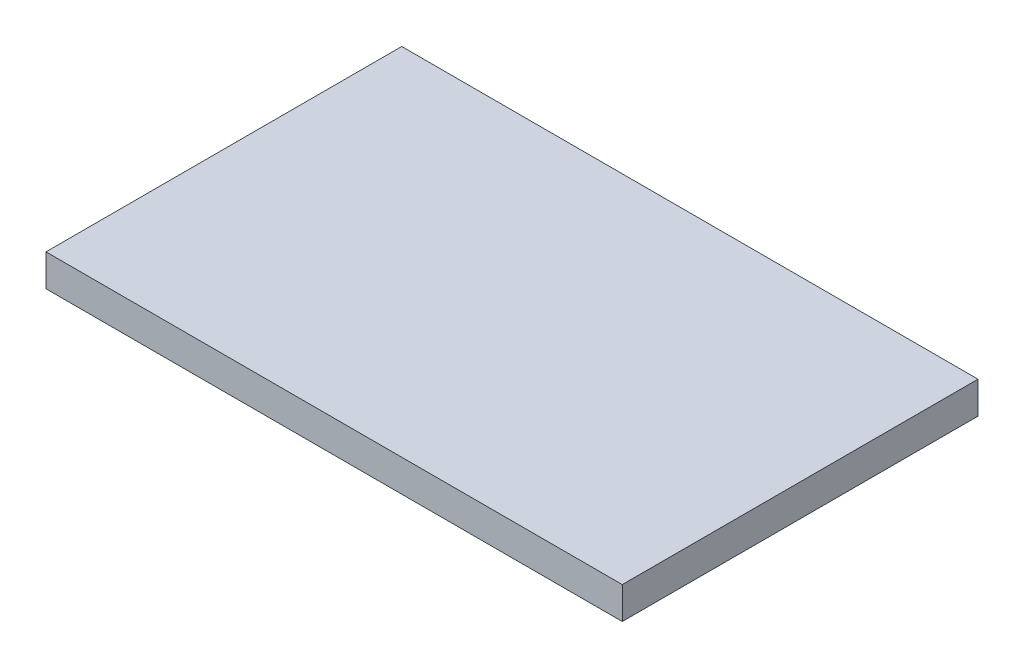
ISO-10303-21;
HEADER;
FILE_DESCRIPTION(('STEP AP214'),'2;1');
FILE_NAME('part.step','',(''),(''),'','','');
FILE_SCHEMA(('AUTOMOTIVE_DESIGN { 1 0 10303 214 1 1 1 1 }'));
ENDSEC;
DATA;
#1=APPLICATION_CONTEXT('core data for automotive mechanical design processes');
#2=APPLICATION_PROTOCOL_DEFINITION('international standard','automotive_design',2000,#1);
#3=PRODUCT_CONTEXT('',#1,'mechanical');
#4=PRODUCT('Part','Part','',(#3));
#5=PRODUCT_RELATED_PRODUCT_CATEGORY('part','',(#4));
#6=PRODUCT_DEFINITION_FORMATION('','',#4);
#7=PRODUCT_DEFINITION_CONTEXT('part definition',#1,'design');
#8=PRODUCT_DEFINITION('design','',#6,#7);
#9=PRODUCT_DEFINITION_SHAPE('','',#8);
#10=(LENGTH_UNIT() NAMED_UNIT(*) SI_UNIT(.MILLI.,.METRE.));
#11=(NAMED_UNIT(*) PLANE_ANGLE_UNIT() SI_UNIT($,.RADIAN.));
#12=(NAMED_UNIT(*) SI_UNIT($,.STERADIAN.) SOLID_ANGLE_UNIT());
#13=UNCERTAINTY_MEASURE_WITH_UNIT(LENGTH_MEASURE(1.E-05),#10,'distance_accuracy_value','');
#14=(GEOMETRIC_REPRESENTATION_CONTEXT(3) GLOBAL_UNCERTAINTY_ASSIGNED_CONTEXT((#13)) GLOBAL_UNIT_ASSIGNED_CONTEXT((#10,
#11,#12)) REPRESENTATION_CONTEXT('',''));
#15=CARTESIAN_POINT('',(0.,0.,0.));
#16=DIRECTION('',(0.,0.,1.));
#17=DIRECTION('',(1.,0.,0.));
#18=AXIS2_PLACEMENT_3D('',#15,#16,#17);
#19=CARTESIAN_POINT('',(40.5,4.5,-25.));
#20=DIRECTION('',(-1.,0.,0.));
#21=DIRECTION('',(0.,0.,1.));
#22=AXIS2_PLACEMENT_3D('',#19,#20,#21);
#23=PLANE('',#22);
#24=DIRECTION('',(0.,0.,-1.));
#25=VECTOR('',#24,1.);
#26=CARTESIAN_POINT('',(40.5,0.,-25.));
#27=LINE('',#26,#25);
#28=CARTESIAN_POINT('',(40.5,0.,25.));
#29=VERTEX_POINT('',#28);
#30=CARTESIAN_POINT('',(40.5,0.,-25.));
#31=VERTEX_POINT('',#30);
#32=EDGE_CURVE('E96',#29,#31,#27,.T.);
#33=ORIENTED_EDGE('',*,*,#32,.T.);
#34=DIRECTION('',(0.,-1.,0.));
#35=VECTOR('',#34,1.);
#36=CARTESIAN_POINT('',(40.5,4.5,-25.));
#37=LINE('',#36,#35);
#38=CARTESIAN_POINT('',(40.5,4.5,-25.));
#39=VERTEX_POINT('',#38);
#40=EDGE_CURVE('E11',#39,#31,#37,.T.);
#41=ORIENTED_EDGE('',*,*,#40,.F.);
#42=DIRECTION('',(0.,0.,-1.));
#43=VECTOR('',#42,1.);
#44=CARTESIAN_POINT('',(40.5,4.5,-25.));
#45=LINE('',#44,#43);
#46=CARTESIAN_POINT('',(40.5,4.5,25.));
#47=VERTEX_POINT('',#46);
#48=EDGE_CURVE('E84',#47,#39,#45,.T.);
#49=ORIENTED_EDGE('',*,*,#48,.F.);
#50=DIRECTION('',(0.,-1.,0.));
#51=VECTOR('',#50,1.);
#52=CARTESIAN_POINT('',(40.5,4.5,25.));
#53=LINE('',#52,#51);
#54=EDGE_CURVE('E92',#47,#29,#53,.T.);
#55=ORIENTED_EDGE('',*,*,#54,.T.);
#56=EDGE_LOOP('',(#33,#41,#49,#55));
#57=FACE_BOUND('',#56,.T.);
#58=ADVANCED_FACE('F33',(#57),#23,.F.);
#59=CARTESIAN_POINT('',(-40.5,4.5,-25.));
#60=DIRECTION('',(0.,0.,1.));
#61=DIRECTION('',(1.,0.,0.));
#62=AXIS2_PLACEMENT_3D('',#59,#60,#61);
#63=PLANE('',#62);
#64=DIRECTION('',(-1.,0.,0.));
#65=VECTOR('',#64,1.);
#66=CARTESIAN_POINT('',(-40.5,0.,-25.));
#67=LINE('',#66,#65);
#68=CARTESIAN_POINT('',(-40.5,0.,-25.));
#69=VERTEX_POINT('',#68);
#70=EDGE_CURVE('E88',#31,#69,#67,.T.);
#71=ORIENTED_EDGE('',*,*,#70,.T.);
#72=DIRECTION('',(0.,-1.,0.));
#73=VECTOR('',#72,1.);
#74=CARTESIAN_POINT('',(-40.5,4.5,-25.));
#75=LINE('',#74,#73);
#76=CARTESIAN_POINT('',(-40.5,4.5,-25.));
#77=VERTEX_POINT('',#76);
#78=EDGE_CURVE('E41',#77,#69,#75,.T.);
#79=ORIENTED_EDGE('',*,*,#78,.F.);
#80=DIRECTION('',(-1.,0.,0.));
#81=VECTOR('',#80,1.);
#82=CARTESIAN_POINT('',(-40.5,4.5,-25.));
#83=LINE('',#82,#81);
#84=EDGE_CURVE('E79',#39,#77,#83,.T.);
#85=ORIENTED_EDGE('',*,*,#84,.F.);
#86=ORIENTED_EDGE('',*,*,#40,.T.);
#87=EDGE_LOOP('',(#71,#79,#85,#86));
#88=FACE_BOUND('',#87,.T.);
#89=ADVANCED_FACE('F87',(#88),#63,.F.);
#90=CARTESIAN_POINT('',(-40.5,4.5,-25.));
#91=DIRECTION('',(1.,0.,0.));
#92=DIRECTION('',(0.,0.,-1.));
#93=AXIS2_PLACEMENT_3D('',#90,#91,#92);
#94=PLANE('',#93);
#95=DIRECTION('',(0.,0.,1.));
#96=VECTOR('',#95,1.);
#97=CARTESIAN_POINT('',(-40.5,0.,-25.));
#98=LINE('',#97,#96);
#99=CARTESIAN_POINT('',(-40.5,0.,25.));
#100=VERTEX_POINT('',#99);
#101=EDGE_CURVE('E66',#69,#100,#98,.T.);
#102=ORIENTED_EDGE('',*,*,#101,.T.);
#103=DIRECTION('',(0.,-1.,0.));
#104=VECTOR('',#103,1.);
#105=CARTESIAN_POINT('',(-40.5,4.5,25.));
#106=LINE('',#105,#104);
#107=CARTESIAN_POINT('',(-40.5,4.5,25.));
#108=VERTEX_POINT('',#107);
#109=EDGE_CURVE('E89',#108,#100,#106,.T.);
#110=ORIENTED_EDGE('',*,*,#109,.F.);
#111=DIRECTION('',(0.,0.,1.));
#112=VECTOR('',#111,1.);
#113=CARTESIAN_POINT('',(-40.5,4.5,-25.));
#114=LINE('',#113,#112);
#115=EDGE_CURVE('E82',#77,#108,#114,.T.);
#116=ORIENTED_EDGE('',*,*,#115,.F.);
#117=ORIENTED_EDGE('',*,*,#78,.T.);
#118=EDGE_LOOP('',(#102,#110,#116,#117));
#119=FACE_BOUND('',#118,.T.);
#120=ADVANCED_FACE('F90',(#119),#94,.F.);
#121=CARTESIAN_POINT('',(-40.5,4.5,25.));
#122=DIRECTION('',(0.,0.,-1.));
#123=DIRECTION('',(-1.,0.,0.));
#124=AXIS2_PLACEMENT_3D('',#121,#122,#123);
#125=PLANE('',#124);
#126=DIRECTION('',(1.,0.,0.));
#127=VECTOR('',#126,1.);
#128=CARTESIAN_POINT('',(-40.5,0.,25.));
#129=LINE('',#128,#127);
#130=EDGE_CURVE('E72',#100,#29,#129,.T.);
#131=ORIENTED_EDGE('',*,*,#130,.T.);
#132=ORIENTED_EDGE('',*,*,#54,.F.);
#133=DIRECTION('',(1.,0.,0.));
#134=VECTOR('',#133,1.);
#135=CARTESIAN_POINT('',(-40.5,4.5,25.));
#136=LINE('',#135,#134);
#137=EDGE_CURVE('E49',#108,#47,#136,.T.);
#138=ORIENTED_EDGE('',*,*,#137,.F.);
#139=ORIENTED_EDGE('',*,*,#109,.T.);
#140=EDGE_LOOP('',(#131,#132,#138,#139));
#141=FACE_BOUND('',#140,.T.);
#142=ADVANCED_FACE('F103',(#141),#125,.F.);
#143=CARTESIAN_POINT('',(0.,4.5,0.));
#144=DIRECTION('',(0.,1.,0.));
#145=DIRECTION('',(0.,0.,1.));
#146=AXIS2_PLACEMENT_3D('',#143,#144,#145);
#147=PLANE('',#146);
#148=ORIENTED_EDGE('',*,*,#48,.T.);
#149=ORIENTED_EDGE('',*,*,#84,.T.);
#150=ORIENTED_EDGE('',*,*,#115,.T.);
#151=ORIENTED_EDGE('',*,*,#137,.T.);
#152=EDGE_LOOP('',(#148,#149,#150,#151));
#153=FACE_BOUND('',#152,.T.);
#154=ADVANCED_FACE('F80',(#153),#147,.T.);
#155=CARTESIAN_POINT('',(0.,0.,0.));
#156=DIRECTION('',(0.,1.,0.));
#157=DIRECTION('',(0.,0.,1.));
#158=AXIS2_PLACEMENT_3D('',#155,#156,#157);
#159=PLANE('',#158);
#160=ORIENTED_EDGE('',*,*,#32,.F.);
#161=ORIENTED_EDGE('',*,*,#130,.F.);
#162=ORIENTED_EDGE('',*,*,#101,.F.);
#163=ORIENTED_EDGE('',*,*,#70,.F.);
#164=EDGE_LOOP('',(#160,#161,#162,#163));
#165=FACE_BOUND('',#164,.T.);
#166=ADVANCED_FACE('F106',(#165),#159,.F.);
#167=CLOSED_SHELL('',(#58,#89,#120,#142,#154,#166));
#168=MANIFOLD_SOLID_BREP('B2',#167);
#169=ADVANCED_BREP_SHAPE_REPRESENTATION('',(#18,#168),#14);
#170=SHAPE_DEFINITION_REPRESENTATION(#9,#169);
ENDSEC;
END-ISO-10303-21;
